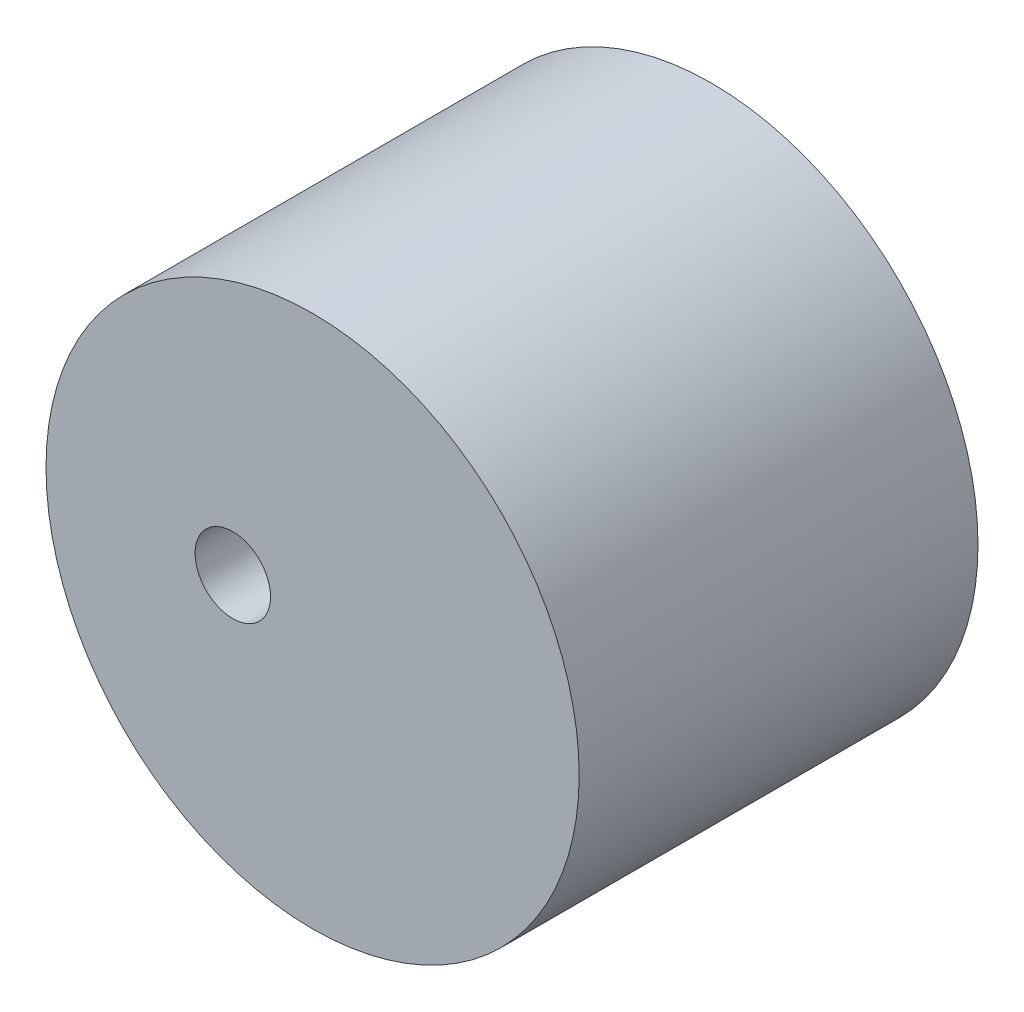
ISO-10303-21;
HEADER;
FILE_DESCRIPTION(('STEP AP214'),'2;1');
FILE_NAME('part.step','',(''),(''),'','','');
FILE_SCHEMA(('AUTOMOTIVE_DESIGN { 1 0 10303 214 1 1 1 1 }'));
ENDSEC;
DATA;
#1=APPLICATION_CONTEXT('core data for automotive mechanical design processes');
#2=APPLICATION_PROTOCOL_DEFINITION('international standard','automotive_design',2000,#1);
#3=PRODUCT_CONTEXT('',#1,'mechanical');
#4=PRODUCT('Part','Part','',(#3));
#5=PRODUCT_RELATED_PRODUCT_CATEGORY('part','',(#4));
#6=PRODUCT_DEFINITION_FORMATION('','',#4);
#7=PRODUCT_DEFINITION_CONTEXT('part definition',#1,'design');
#8=PRODUCT_DEFINITION('design','',#6,#7);
#9=PRODUCT_DEFINITION_SHAPE('','',#8);
#10=(LENGTH_UNIT() NAMED_UNIT(*) SI_UNIT(.MILLI.,.METRE.));
#11=(NAMED_UNIT(*) PLANE_ANGLE_UNIT() SI_UNIT($,.RADIAN.));
#12=(NAMED_UNIT(*) SI_UNIT($,.STERADIAN.) SOLID_ANGLE_UNIT());
#13=UNCERTAINTY_MEASURE_WITH_UNIT(LENGTH_MEASURE(1.E-05),#10,'distance_accuracy_value','');
#14=(GEOMETRIC_REPRESENTATION_CONTEXT(3) GLOBAL_UNCERTAINTY_ASSIGNED_CONTEXT((#13)) GLOBAL_UNIT_ASSIGNED_CONTEXT((#10,
#11,#12)) REPRESENTATION_CONTEXT('',''));
#15=CARTESIAN_POINT('',(0.,0.,0.));
#16=DIRECTION('',(0.,0.,1.));
#17=DIRECTION('',(1.,0.,0.));
#18=AXIS2_PLACEMENT_3D('',#15,#16,#17);
#19=CARTESIAN_POINT('',(0.,0.,35.));
#20=DIRECTION('',(0.,0.,1.));
#21=DIRECTION('',(1.,0.,0.));
#22=AXIS2_PLACEMENT_3D('',#19,#20,#21);
#23=PLANE('',#22);
#24=CARTESIAN_POINT('',(0.,0.,35.));
#25=DIRECTION('',(0.,0.,1.));
#26=DIRECTION('',(1.,0.,0.));
#27=AXIS2_PLACEMENT_3D('',#24,#25,#26);
#28=CIRCLE('',#27,23.39375);
#29=CARTESIAN_POINT('',(23.39375,0.,35.));
#30=VERTEX_POINT('',#29);
#31=EDGE_CURVE('E10',#30,#30,#28,.T.);
#32=ORIENTED_EDGE('',*,*,#31,.T.);
#33=EDGE_LOOP('',(#32));
#34=FACE_BOUND('',#33,.T.);
#35=CARTESIAN_POINT('',(-7.,0.,35.));
#36=DIRECTION('',(0.,0.,1.));
#37=DIRECTION('',(1.,0.,0.));
#38=AXIS2_PLACEMENT_3D('',#35,#36,#37);
#39=CIRCLE('',#38,3.3085);
#40=CARTESIAN_POINT('',(-3.6915,0.,35.));
#41=VERTEX_POINT('',#40);
#42=EDGE_CURVE('E50',#41,#41,#39,.T.);
#43=ORIENTED_EDGE('',*,*,#42,.F.);
#44=EDGE_LOOP('',(#43));
#45=FACE_BOUND('',#44,.T.);
#46=ADVANCED_FACE('F37',(#34,#45),#23,.T.);
#47=CARTESIAN_POINT('',(0.,0.,0.));
#48=DIRECTION('',(0.,0.,1.));
#49=DIRECTION('',(1.,0.,0.));
#50=AXIS2_PLACEMENT_3D('',#47,#48,#49);
#51=PLANE('',#50);
#52=CARTESIAN_POINT('',(0.,0.,0.));
#53=DIRECTION('',(0.,0.,1.));
#54=DIRECTION('',(1.,0.,0.));
#55=AXIS2_PLACEMENT_3D('',#52,#53,#54);
#56=CIRCLE('',#55,23.39375);
#57=CARTESIAN_POINT('',(23.39375,0.,0.));
#58=VERTEX_POINT('',#57);
#59=EDGE_CURVE('E41',#58,#58,#56,.T.);
#60=ORIENTED_EDGE('',*,*,#59,.F.);
#61=EDGE_LOOP('',(#60));
#62=FACE_BOUND('',#61,.T.);
#63=CARTESIAN_POINT('',(-7.,0.,0.));
#64=DIRECTION('',(0.,0.,1.));
#65=DIRECTION('',(1.,0.,0.));
#66=AXIS2_PLACEMENT_3D('',#63,#64,#65);
#67=CIRCLE('',#66,3.3085);
#68=CARTESIAN_POINT('',(-3.6915,0.,0.));
#69=VERTEX_POINT('',#68);
#70=EDGE_CURVE('E52',#69,#69,#67,.T.);
#71=ORIENTED_EDGE('',*,*,#70,.T.);
#72=EDGE_LOOP('',(#71));
#73=FACE_BOUND('',#72,.T.);
#74=ADVANCED_FACE('F64',(#62,#73),#51,.F.);
#75=CARTESIAN_POINT('',(0.,0.,35.));
#76=DIRECTION('',(0.,0.,-1.));
#77=DIRECTION('',(-1.,0.,0.));
#78=AXIS2_PLACEMENT_3D('',#75,#76,#77);
#79=CYLINDRICAL_SURFACE('',#78,23.39375);
#80=ORIENTED_EDGE('',*,*,#31,.F.);
#81=EDGE_LOOP('',(#80));
#82=FACE_BOUND('',#81,.T.);
#83=ORIENTED_EDGE('',*,*,#59,.T.);
#84=EDGE_LOOP('',(#83));
#85=FACE_BOUND('',#84,.T.);
#86=ADVANCED_FACE('F39',(#82,#85),#79,.T.);
#87=CARTESIAN_POINT('',(-7.,0.,35.));
#88=DIRECTION('',(0.,0.,-1.));
#89=DIRECTION('',(-1.,0.,0.));
#90=AXIS2_PLACEMENT_3D('',#87,#88,#89);
#91=CYLINDRICAL_SURFACE('',#90,3.3085);
#92=ORIENTED_EDGE('',*,*,#42,.T.);
#93=EDGE_LOOP('',(#92));
#94=FACE_BOUND('',#93,.T.);
#95=ORIENTED_EDGE('',*,*,#70,.F.);
#96=EDGE_LOOP('',(#95));
#97=FACE_BOUND('',#96,.T.);
#98=ADVANCED_FACE('F60',(#94,#97),#91,.F.);
#99=CLOSED_SHELL('',(#46,#74,#86,#98));
#100=MANIFOLD_SOLID_BREP('B2',#99);
#101=ADVANCED_BREP_SHAPE_REPRESENTATION('',(#18,#100),#14);
#102=SHAPE_DEFINITION_REPRESENTATION(#9,#101);
ENDSEC;
END-ISO-10303-21;
